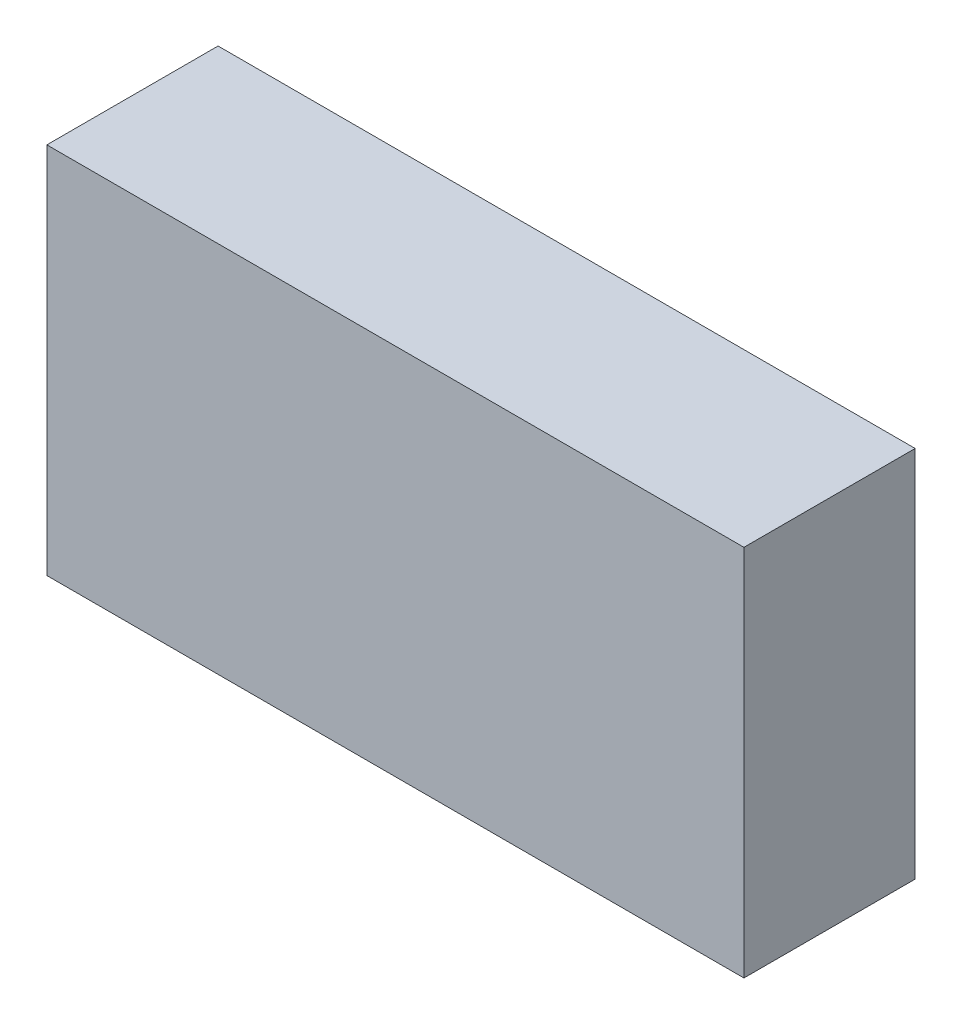
ISO-10303-21;
HEADER;
FILE_DESCRIPTION(('STEP AP214'),'2;1');
FILE_NAME('part.step','',(''),(''),'','','');
FILE_SCHEMA(('AUTOMOTIVE_DESIGN { 1 0 10303 214 1 1 1 1 }'));
ENDSEC;
DATA;
#1=APPLICATION_CONTEXT('core data for automotive mechanical design processes');
#2=APPLICATION_PROTOCOL_DEFINITION('international standard','automotive_design',2000,#1);
#3=PRODUCT_CONTEXT('',#1,'mechanical');
#4=PRODUCT('Part','Part','',(#3));
#5=PRODUCT_RELATED_PRODUCT_CATEGORY('part','',(#4));
#6=PRODUCT_DEFINITION_FORMATION('','',#4);
#7=PRODUCT_DEFINITION_CONTEXT('part definition',#1,'design');
#8=PRODUCT_DEFINITION('design','',#6,#7);
#9=PRODUCT_DEFINITION_SHAPE('','',#8);
#10=(LENGTH_UNIT() NAMED_UNIT(*) SI_UNIT(.MILLI.,.METRE.));
#11=(NAMED_UNIT(*) PLANE_ANGLE_UNIT() SI_UNIT($,.RADIAN.));
#12=(NAMED_UNIT(*) SI_UNIT($,.STERADIAN.) SOLID_ANGLE_UNIT());
#13=UNCERTAINTY_MEASURE_WITH_UNIT(LENGTH_MEASURE(1.E-05),#10,'distance_accuracy_value','');
#14=(GEOMETRIC_REPRESENTATION_CONTEXT(3) GLOBAL_UNCERTAINTY_ASSIGNED_CONTEXT((#13)) GLOBAL_UNIT_ASSIGNED_CONTEXT((#10,
#11,#12)) REPRESENTATION_CONTEXT('',''));
#15=CARTESIAN_POINT('',(0.,0.,0.));
#16=DIRECTION('',(0.,0.,1.));
#17=DIRECTION('',(1.,0.,0.));
#18=AXIS2_PLACEMENT_3D('',#15,#16,#17);
#19=CARTESIAN_POINT('',(-28.5,-15.25,14.));
#20=DIRECTION('',(1.,0.,0.));
#21=DIRECTION('',(0.,0.,-1.));
#22=AXIS2_PLACEMENT_3D('',#19,#20,#21);
#23=PLANE('',#22);
#24=DIRECTION('',(0.,-1.,0.));
#25=VECTOR('',#24,1.);
#26=CARTESIAN_POINT('',(-28.5,-15.25,0.));
#27=LINE('',#26,#25);
#28=CARTESIAN_POINT('',(-28.5,15.25,0.));
#29=VERTEX_POINT('',#28);
#30=CARTESIAN_POINT('',(-28.5,-15.25,0.));
#31=VERTEX_POINT('',#30);
#32=EDGE_CURVE('E95',#29,#31,#27,.T.);
#33=ORIENTED_EDGE('',*,*,#32,.T.);
#34=DIRECTION('',(0.,0.,-1.));
#35=VECTOR('',#34,1.);
#36=CARTESIAN_POINT('',(-28.5,-15.25,14.));
#37=LINE('',#36,#35);
#38=CARTESIAN_POINT('',(-28.5,-15.25,14.));
#39=VERTEX_POINT('',#38);
#40=EDGE_CURVE('E11',#39,#31,#37,.T.);
#41=ORIENTED_EDGE('',*,*,#40,.F.);
#42=DIRECTION('',(0.,-1.,0.));
#43=VECTOR('',#42,1.);
#44=CARTESIAN_POINT('',(-28.5,-15.25,14.));
#45=LINE('',#44,#43);
#46=CARTESIAN_POINT('',(-28.5,15.25,14.));
#47=VERTEX_POINT('',#46);
#48=EDGE_CURVE('E83',#47,#39,#45,.T.);
#49=ORIENTED_EDGE('',*,*,#48,.F.);
#50=DIRECTION('',(0.,0.,-1.));
#51=VECTOR('',#50,1.);
#52=CARTESIAN_POINT('',(-28.5,15.25,14.));
#53=LINE('',#52,#51);
#54=EDGE_CURVE('E91',#47,#29,#53,.T.);
#55=ORIENTED_EDGE('',*,*,#54,.T.);
#56=EDGE_LOOP('',(#33,#41,#49,#55));
#57=FACE_BOUND('',#56,.T.);
#58=ADVANCED_FACE('F32',(#57),#23,.F.);
#59=CARTESIAN_POINT('',(28.5,-15.25,14.));
#60=DIRECTION('',(0.,1.,0.));
#61=DIRECTION('',(-1.,0.,0.));
#62=AXIS2_PLACEMENT_3D('',#59,#60,#61);
#63=PLANE('',#62);
#64=DIRECTION('',(1.,0.,0.));
#65=VECTOR('',#64,1.);
#66=CARTESIAN_POINT('',(28.5,-15.25,0.));
#67=LINE('',#66,#65);
#68=CARTESIAN_POINT('',(28.5,-15.25,0.));
#69=VERTEX_POINT('',#68);
#70=EDGE_CURVE('E87',#31,#69,#67,.T.);
#71=ORIENTED_EDGE('',*,*,#70,.T.);
#72=DIRECTION('',(0.,0.,-1.));
#73=VECTOR('',#72,1.);
#74=CARTESIAN_POINT('',(28.5,-15.25,14.));
#75=LINE('',#74,#73);
#76=CARTESIAN_POINT('',(28.5,-15.25,14.));
#77=VERTEX_POINT('',#76);
#78=EDGE_CURVE('E40',#77,#69,#75,.T.);
#79=ORIENTED_EDGE('',*,*,#78,.F.);
#80=DIRECTION('',(1.,0.,0.));
#81=VECTOR('',#80,1.);
#82=CARTESIAN_POINT('',(28.5,-15.25,14.));
#83=LINE('',#82,#81);
#84=EDGE_CURVE('E78',#39,#77,#83,.T.);
#85=ORIENTED_EDGE('',*,*,#84,.F.);
#86=ORIENTED_EDGE('',*,*,#40,.T.);
#87=EDGE_LOOP('',(#71,#79,#85,#86));
#88=FACE_BOUND('',#87,.T.);
#89=ADVANCED_FACE('F86',(#88),#63,.F.);
#90=CARTESIAN_POINT('',(28.5,-15.25,14.));
#91=DIRECTION('',(-1.,0.,0.));
#92=DIRECTION('',(0.,0.,1.));
#93=AXIS2_PLACEMENT_3D('',#90,#91,#92);
#94=PLANE('',#93);
#95=DIRECTION('',(0.,1.,0.));
#96=VECTOR('',#95,1.);
#97=CARTESIAN_POINT('',(28.5,-15.25,0.));
#98=LINE('',#97,#96);
#99=CARTESIAN_POINT('',(28.5,15.25,0.));
#100=VERTEX_POINT('',#99);
#101=EDGE_CURVE('E65',#69,#100,#98,.T.);
#102=ORIENTED_EDGE('',*,*,#101,.T.);
#103=DIRECTION('',(0.,0.,-1.));
#104=VECTOR('',#103,1.);
#105=CARTESIAN_POINT('',(28.5,15.25,14.));
#106=LINE('',#105,#104);
#107=CARTESIAN_POINT('',(28.5,15.25,14.));
#108=VERTEX_POINT('',#107);
#109=EDGE_CURVE('E88',#108,#100,#106,.T.);
#110=ORIENTED_EDGE('',*,*,#109,.F.);
#111=DIRECTION('',(0.,1.,0.));
#112=VECTOR('',#111,1.);
#113=CARTESIAN_POINT('',(28.5,-15.25,14.));
#114=LINE('',#113,#112);
#115=EDGE_CURVE('E81',#77,#108,#114,.T.);
#116=ORIENTED_EDGE('',*,*,#115,.F.);
#117=ORIENTED_EDGE('',*,*,#78,.T.);
#118=EDGE_LOOP('',(#102,#110,#116,#117));
#119=FACE_BOUND('',#118,.T.);
#120=ADVANCED_FACE('F89',(#119),#94,.F.);
#121=CARTESIAN_POINT('',(28.5,15.25,14.));
#122=DIRECTION('',(0.,-1.,0.));
#123=DIRECTION('',(1.,0.,0.));
#124=AXIS2_PLACEMENT_3D('',#121,#122,#123);
#125=PLANE('',#124);
#126=DIRECTION('',(-1.,0.,0.));
#127=VECTOR('',#126,1.);
#128=CARTESIAN_POINT('',(28.5,15.25,0.));
#129=LINE('',#128,#127);
#130=EDGE_CURVE('E71',#100,#29,#129,.T.);
#131=ORIENTED_EDGE('',*,*,#130,.T.);
#132=ORIENTED_EDGE('',*,*,#54,.F.);
#133=DIRECTION('',(-1.,0.,0.));
#134=VECTOR('',#133,1.);
#135=CARTESIAN_POINT('',(28.5,15.25,14.));
#136=LINE('',#135,#134);
#137=EDGE_CURVE('E48',#108,#47,#136,.T.);
#138=ORIENTED_EDGE('',*,*,#137,.F.);
#139=ORIENTED_EDGE('',*,*,#109,.T.);
#140=EDGE_LOOP('',(#131,#132,#138,#139));
#141=FACE_BOUND('',#140,.T.);
#142=ADVANCED_FACE('F102',(#141),#125,.F.);
#143=CARTESIAN_POINT('',(0.,0.,14.));
#144=DIRECTION('',(0.,0.,1.));
#145=DIRECTION('',(1.,0.,0.));
#146=AXIS2_PLACEMENT_3D('',#143,#144,#145);
#147=PLANE('',#146);
#148=ORIENTED_EDGE('',*,*,#48,.T.);
#149=ORIENTED_EDGE('',*,*,#84,.T.);
#150=ORIENTED_EDGE('',*,*,#115,.T.);
#151=ORIENTED_EDGE('',*,*,#137,.T.);
#152=EDGE_LOOP('',(#148,#149,#150,#151));
#153=FACE_BOUND('',#152,.T.);
#154=ADVANCED_FACE('F79',(#153),#147,.T.);
#155=CARTESIAN_POINT('',(0.,0.,0.));
#156=DIRECTION('',(0.,0.,1.));
#157=DIRECTION('',(1.,0.,0.));
#158=AXIS2_PLACEMENT_3D('',#155,#156,#157);
#159=PLANE('',#158);
#160=ORIENTED_EDGE('',*,*,#32,.F.);
#161=ORIENTED_EDGE('',*,*,#130,.F.);
#162=ORIENTED_EDGE('',*,*,#101,.F.);
#163=ORIENTED_EDGE('',*,*,#70,.F.);
#164=EDGE_LOOP('',(#160,#161,#162,#163));
#165=FACE_BOUND('',#164,.T.);
#166=ADVANCED_FACE('F105',(#165),#159,.F.);
#167=CLOSED_SHELL('',(#58,#89,#120,#142,#154,#166));
#168=MANIFOLD_SOLID_BREP('B2',#167);
#169=ADVANCED_BREP_SHAPE_REPRESENTATION('',(#18,#168),#14);
#170=SHAPE_DEFINITION_REPRESENTATION(#9,#169);
ENDSEC;
END-ISO-10303-21;
